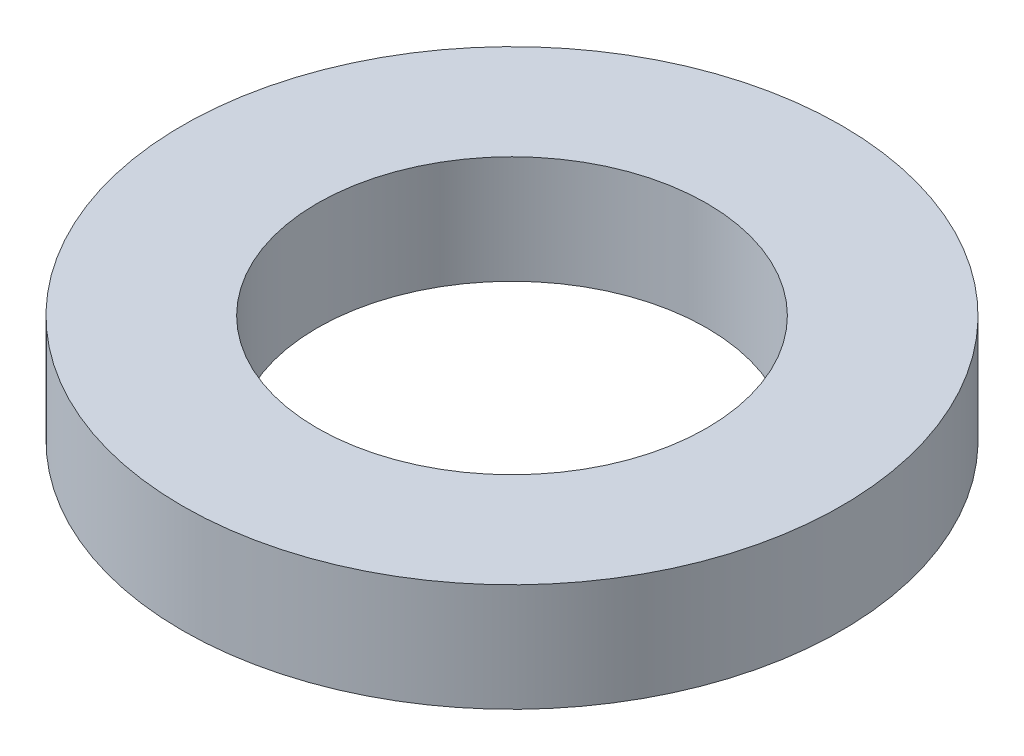
ISO-10303-21;
HEADER;
FILE_DESCRIPTION(('STEP AP214'),'2;1');
FILE_NAME('part.step','',(''),(''),'','','');
FILE_SCHEMA(('AUTOMOTIVE_DESIGN { 1 0 10303 214 1 1 1 1 }'));
ENDSEC;
DATA;
#1=APPLICATION_CONTEXT('core data for automotive mechanical design processes');
#2=APPLICATION_PROTOCOL_DEFINITION('international standard','automotive_design',2000,#1);
#3=PRODUCT_CONTEXT('',#1,'mechanical');
#4=PRODUCT('Part','Part','',(#3));
#5=PRODUCT_RELATED_PRODUCT_CATEGORY('part','',(#4));
#6=PRODUCT_DEFINITION_FORMATION('','',#4);
#7=PRODUCT_DEFINITION_CONTEXT('part definition',#1,'design');
#8=PRODUCT_DEFINITION('design','',#6,#7);
#9=PRODUCT_DEFINITION_SHAPE('','',#8);
#10=(LENGTH_UNIT() NAMED_UNIT(*) SI_UNIT(.MILLI.,.METRE.));
#11=(NAMED_UNIT(*) PLANE_ANGLE_UNIT() SI_UNIT($,.RADIAN.));
#12=(NAMED_UNIT(*) SI_UNIT($,.STERADIAN.) SOLID_ANGLE_UNIT());
#13=UNCERTAINTY_MEASURE_WITH_UNIT(LENGTH_MEASURE(1.E-05),#10,'distance_accuracy_value','');
#14=(GEOMETRIC_REPRESENTATION_CONTEXT(3) GLOBAL_UNCERTAINTY_ASSIGNED_CONTEXT((#13)) GLOBAL_UNIT_ASSIGNED_CONTEXT((#10,
#11,#12)) REPRESENTATION_CONTEXT('',''));
#15=CARTESIAN_POINT('',(0.,0.,0.));
#16=DIRECTION('',(0.,0.,1.));
#17=DIRECTION('',(1.,0.,0.));
#18=AXIS2_PLACEMENT_3D('',#15,#16,#17);
#19=CARTESIAN_POINT('',(0.,18.,0.));
#20=DIRECTION('',(0.,-1.,0.));
#21=DIRECTION('',(0.,0.,-1.));
#22=AXIS2_PLACEMENT_3D('',#19,#20,#21);
#23=CYLINDRICAL_SURFACE('',#22,55.);
#24=CARTESIAN_POINT('',(0.,18.,0.));
#25=DIRECTION('',(0.,1.,0.));
#26=DIRECTION('',(0.,0.,1.));
#27=AXIS2_PLACEMENT_3D('',#24,#25,#26);
#28=CIRCLE('',#27,55.);
#29=CARTESIAN_POINT('',(0.,18.,55.));
#30=VERTEX_POINT('',#29);
#31=EDGE_CURVE('E10',#30,#30,#28,.T.);
#32=ORIENTED_EDGE('',*,*,#31,.F.);
#33=EDGE_LOOP('',(#32));
#34=FACE_BOUND('',#33,.T.);
#35=CARTESIAN_POINT('',(0.,0.,0.));
#36=DIRECTION('',(0.,1.,0.));
#37=DIRECTION('',(0.,0.,1.));
#38=AXIS2_PLACEMENT_3D('',#35,#36,#37);
#39=CIRCLE('',#38,55.);
#40=CARTESIAN_POINT('',(0.,0.,55.));
#41=VERTEX_POINT('',#40);
#42=EDGE_CURVE('E37',#41,#41,#39,.T.);
#43=ORIENTED_EDGE('',*,*,#42,.T.);
#44=EDGE_LOOP('',(#43));
#45=FACE_BOUND('',#44,.T.);
#46=ADVANCED_FACE('F40',(#34,#45),#23,.T.);
#47=CARTESIAN_POINT('',(0.,18.,0.));
#48=DIRECTION('',(0.,1.,0.));
#49=DIRECTION('',(0.,0.,1.));
#50=AXIS2_PLACEMENT_3D('',#47,#48,#49);
#51=PLANE('',#50);
#52=CARTESIAN_POINT('',(0.,18.,0.));
#53=DIRECTION('',(0.,1.,0.));
#54=DIRECTION('',(0.,0.,1.));
#55=AXIS2_PLACEMENT_3D('',#52,#53,#54);
#56=CIRCLE('',#55,32.5);
#57=CARTESIAN_POINT('',(0.,18.,32.5));
#58=VERTEX_POINT('',#57);
#59=EDGE_CURVE('E50',#58,#58,#56,.T.);
#60=ORIENTED_EDGE('',*,*,#59,.F.);
#61=EDGE_LOOP('',(#60));
#62=FACE_BOUND('',#61,.T.);
#63=ORIENTED_EDGE('',*,*,#31,.T.);
#64=EDGE_LOOP('',(#63));
#65=FACE_BOUND('',#64,.T.);
#66=ADVANCED_FACE('F59',(#62,#65),#51,.T.);
#67=CARTESIAN_POINT('',(0.,0.,0.));
#68=DIRECTION('',(0.,1.,0.));
#69=DIRECTION('',(0.,0.,1.));
#70=AXIS2_PLACEMENT_3D('',#67,#68,#69);
#71=PLANE('',#70);
#72=CARTESIAN_POINT('',(0.,0.,0.));
#73=DIRECTION('',(0.,1.,0.));
#74=DIRECTION('',(0.,0.,1.));
#75=AXIS2_PLACEMENT_3D('',#72,#73,#74);
#76=CIRCLE('',#75,32.5);
#77=CARTESIAN_POINT('',(0.,0.,32.5));
#78=VERTEX_POINT('',#77);
#79=EDGE_CURVE('E47',#78,#78,#76,.T.);
#80=ORIENTED_EDGE('',*,*,#79,.T.);
#81=EDGE_LOOP('',(#80));
#82=FACE_BOUND('',#81,.T.);
#83=ORIENTED_EDGE('',*,*,#42,.F.);
#84=EDGE_LOOP('',(#83));
#85=FACE_BOUND('',#84,.T.);
#86=ADVANCED_FACE('F58',(#82,#85),#71,.F.);
#87=CARTESIAN_POINT('',(0.,18.,0.));
#88=DIRECTION('',(0.,-1.,0.));
#89=DIRECTION('',(0.,0.,-1.));
#90=AXIS2_PLACEMENT_3D('',#87,#88,#89);
#91=CYLINDRICAL_SURFACE('',#90,32.5);
#92=ORIENTED_EDGE('',*,*,#59,.T.);
#93=EDGE_LOOP('',(#92));
#94=FACE_BOUND('',#93,.T.);
#95=ORIENTED_EDGE('',*,*,#79,.F.);
#96=EDGE_LOOP('',(#95));
#97=FACE_BOUND('',#96,.T.);
#98=ADVANCED_FACE('F54',(#94,#97),#91,.F.);
#99=CLOSED_SHELL('',(#46,#66,#86,#98));
#100=MANIFOLD_SOLID_BREP('B2',#99);
#101=ADVANCED_BREP_SHAPE_REPRESENTATION('',(#18,#100),#14);
#102=SHAPE_DEFINITION_REPRESENTATION(#9,#101);
ENDSEC;
END-ISO-10303-21;
